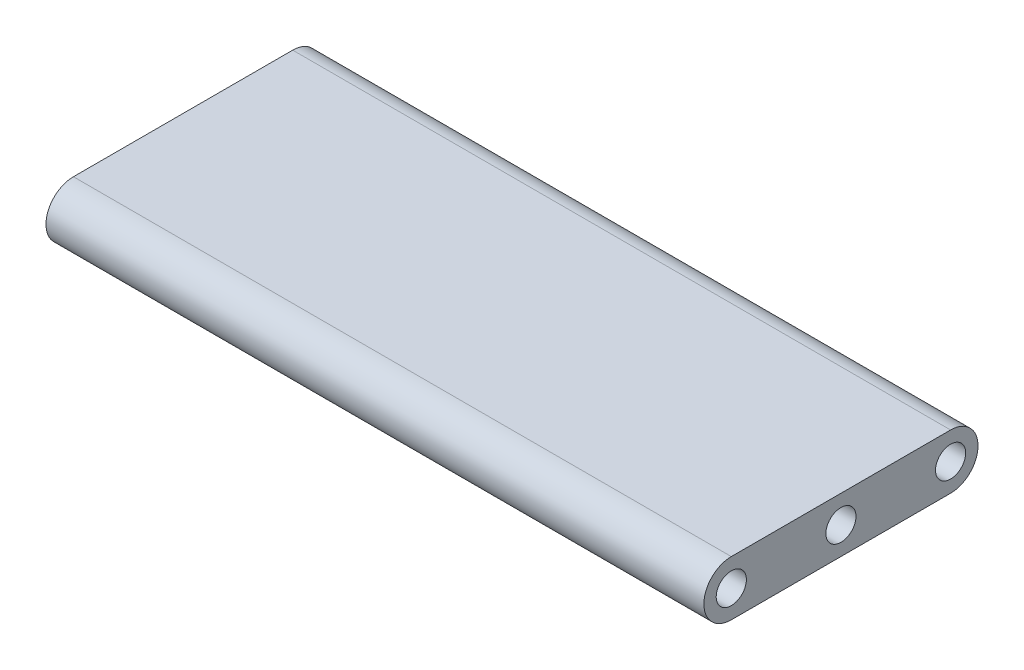
ISO-10303-21;
HEADER;
FILE_DESCRIPTION(('STEP AP214'),'2;1');
FILE_NAME('part.step','',(''),(''),'','','');
FILE_SCHEMA(('AUTOMOTIVE_DESIGN { 1 0 10303 214 1 1 1 1 }'));
ENDSEC;
DATA;
#1=APPLICATION_CONTEXT('core data for automotive mechanical design processes');
#2=APPLICATION_PROTOCOL_DEFINITION('international standard','automotive_design',2000,#1);
#3=PRODUCT_CONTEXT('',#1,'mechanical');
#4=PRODUCT('Part','Part','',(#3));
#5=PRODUCT_RELATED_PRODUCT_CATEGORY('part','',(#4));
#6=PRODUCT_DEFINITION_FORMATION('','',#4);
#7=PRODUCT_DEFINITION_CONTEXT('part definition',#1,'design');
#8=PRODUCT_DEFINITION('design','',#6,#7);
#9=PRODUCT_DEFINITION_SHAPE('','',#8);
#10=(LENGTH_UNIT() NAMED_UNIT(*) SI_UNIT(.MILLI.,.METRE.));
#11=(NAMED_UNIT(*) PLANE_ANGLE_UNIT() SI_UNIT($,.RADIAN.));
#12=(NAMED_UNIT(*) SI_UNIT($,.STERADIAN.) SOLID_ANGLE_UNIT());
#13=UNCERTAINTY_MEASURE_WITH_UNIT(LENGTH_MEASURE(1.E-05),#10,'distance_accuracy_value','');
#14=(GEOMETRIC_REPRESENTATION_CONTEXT(3) GLOBAL_UNCERTAINTY_ASSIGNED_CONTEXT((#13)) GLOBAL_UNIT_ASSIGNED_CONTEXT((#10,
#11,#12)) REPRESENTATION_CONTEXT('',''));
#15=CARTESIAN_POINT('',(0.,0.,0.));
#16=DIRECTION('',(0.,0.,1.));
#17=DIRECTION('',(1.,0.,0.));
#18=AXIS2_PLACEMENT_3D('',#15,#16,#17);
#19=CARTESIAN_POINT('',(76.2,-6.35000000000001,0.));
#20=DIRECTION('',(0.,1.,0.));
#21=DIRECTION('',(0.,0.,1.));
#22=AXIS2_PLACEMENT_3D('',#19,#20,#21);
#23=PLANE('',#22);
#24=DIRECTION('',(0.,0.,-1.));
#25=VECTOR('',#24,1.);
#26=CARTESIAN_POINT('',(-76.2,-6.35000000000001,0.));
#27=LINE('',#26,#25);
#28=CARTESIAN_POINT('',(-76.2,-6.35000000000001,25.4));
#29=VERTEX_POINT('',#28);
#30=CARTESIAN_POINT('',(-76.2,-6.35,-25.4));
#31=VERTEX_POINT('',#30);
#32=EDGE_CURVE('E127',#29,#31,#27,.T.);
#33=ORIENTED_EDGE('',*,*,#32,.T.);
#34=DIRECTION('',(-1.,0.,0.));
#35=VECTOR('',#34,1.);
#36=CARTESIAN_POINT('',(76.2,-6.35,-25.4));
#37=LINE('',#36,#35);
#38=CARTESIAN_POINT('',(76.2,-6.35,-25.4));
#39=VERTEX_POINT('',#38);
#40=EDGE_CURVE('E11',#39,#31,#37,.T.);
#41=ORIENTED_EDGE('',*,*,#40,.F.);
#42=DIRECTION('',(0.,0.,-1.));
#43=VECTOR('',#42,1.);
#44=CARTESIAN_POINT('',(76.2,-6.35000000000001,0.));
#45=LINE('',#44,#43);
#46=CARTESIAN_POINT('',(76.2,-6.35000000000001,25.4));
#47=VERTEX_POINT('',#46);
#48=EDGE_CURVE('E96',#47,#39,#45,.T.);
#49=ORIENTED_EDGE('',*,*,#48,.F.);
#50=DIRECTION('',(-1.,0.,0.));
#51=VECTOR('',#50,1.);
#52=CARTESIAN_POINT('',(76.2,-6.35000000000001,25.4));
#53=LINE('',#52,#51);
#54=EDGE_CURVE('E111',#47,#29,#53,.T.);
#55=ORIENTED_EDGE('',*,*,#54,.T.);
#56=EDGE_LOOP('',(#33,#41,#49,#55));
#57=FACE_BOUND('',#56,.T.);
#58=ADVANCED_FACE('F47',(#57),#23,.F.);
#59=CARTESIAN_POINT('',(76.2,0.,-25.4));
#60=DIRECTION('',(-1.,0.,0.));
#61=DIRECTION('',(0.,0.,1.));
#62=AXIS2_PLACEMENT_3D('',#59,#60,#61);
#63=CYLINDRICAL_SURFACE('',#62,6.35000000000001);
#64=CARTESIAN_POINT('',(-76.2,0.,-25.4));
#65=DIRECTION('',(1.,0.,0.));
#66=DIRECTION('',(0.,0.,-1.));
#67=AXIS2_PLACEMENT_3D('',#64,#65,#66);
#68=CIRCLE('',#67,6.35000000000001);
#69=CARTESIAN_POINT('',(-76.2,6.35,-25.4));
#70=VERTEX_POINT('',#69);
#71=EDGE_CURVE('E102',#31,#70,#68,.T.);
#72=ORIENTED_EDGE('',*,*,#71,.T.);
#73=DIRECTION('',(-1.,0.,0.));
#74=VECTOR('',#73,1.);
#75=CARTESIAN_POINT('',(76.2,6.35,-25.4));
#76=LINE('',#75,#74);
#77=CARTESIAN_POINT('',(76.2,6.35,-25.4));
#78=VERTEX_POINT('',#77);
#79=EDGE_CURVE('E57',#78,#70,#76,.T.);
#80=ORIENTED_EDGE('',*,*,#79,.F.);
#81=CARTESIAN_POINT('',(76.2,0.,-25.4));
#82=DIRECTION('',(1.,0.,0.));
#83=DIRECTION('',(0.,0.,-1.));
#84=AXIS2_PLACEMENT_3D('',#81,#82,#83);
#85=CIRCLE('',#84,6.35000000000001);
#86=EDGE_CURVE('E91',#39,#78,#85,.T.);
#87=ORIENTED_EDGE('',*,*,#86,.F.);
#88=ORIENTED_EDGE('',*,*,#40,.T.);
#89=EDGE_LOOP('',(#72,#80,#87,#88));
#90=FACE_BOUND('',#89,.T.);
#91=ADVANCED_FACE('F101',(#90),#63,.T.);
#92=CARTESIAN_POINT('',(76.2,6.35,0.));
#93=DIRECTION('',(0.,1.,0.));
#94=DIRECTION('',(0.,0.,1.));
#95=AXIS2_PLACEMENT_3D('',#92,#93,#94);
#96=PLANE('',#95);
#97=DIRECTION('',(0.,0.,-1.));
#98=VECTOR('',#97,1.);
#99=CARTESIAN_POINT('',(-76.2,6.35,0.));
#100=LINE('',#99,#98);
#101=CARTESIAN_POINT('',(-76.2,6.35000000000001,25.4));
#102=VERTEX_POINT('',#101);
#103=EDGE_CURVE('E133',#102,#70,#100,.T.);
#104=ORIENTED_EDGE('',*,*,#103,.F.);
#105=DIRECTION('',(-1.,0.,0.));
#106=VECTOR('',#105,1.);
#107=CARTESIAN_POINT('',(76.2,6.35000000000001,25.4));
#108=LINE('',#107,#106);
#109=CARTESIAN_POINT('',(76.2,6.35000000000001,25.4));
#110=VERTEX_POINT('',#109);
#111=EDGE_CURVE('E81',#110,#102,#108,.T.);
#112=ORIENTED_EDGE('',*,*,#111,.F.);
#113=DIRECTION('',(0.,0.,-1.));
#114=VECTOR('',#113,1.);
#115=CARTESIAN_POINT('',(76.2,6.35,0.));
#116=LINE('',#115,#114);
#117=EDGE_CURVE('E94',#110,#78,#116,.T.);
#118=ORIENTED_EDGE('',*,*,#117,.T.);
#119=ORIENTED_EDGE('',*,*,#79,.T.);
#120=EDGE_LOOP('',(#104,#112,#118,#119));
#121=FACE_BOUND('',#120,.T.);
#122=ADVANCED_FACE('F107',(#121),#96,.T.);
#123=CARTESIAN_POINT('',(76.2,0.,-25.4));
#124=DIRECTION('',(-1.,0.,0.));
#125=DIRECTION('',(0.,0.,1.));
#126=AXIS2_PLACEMENT_3D('',#123,#124,#125);
#127=CYLINDRICAL_SURFACE('',#126,3.4925);
#128=CARTESIAN_POINT('',(76.2,0.,-25.4));
#129=DIRECTION('',(1.,0.,0.));
#130=DIRECTION('',(0.,0.,-1.));
#131=AXIS2_PLACEMENT_3D('',#128,#129,#130);
#132=CIRCLE('',#131,3.4925);
#133=CARTESIAN_POINT('',(76.2,0.,-28.8925));
#134=VERTEX_POINT('',#133);
#135=EDGE_CURVE('E185',#134,#134,#132,.T.);
#136=ORIENTED_EDGE('',*,*,#135,.T.);
#137=EDGE_LOOP('',(#136));
#138=FACE_BOUND('',#137,.T.);
#139=CARTESIAN_POINT('',(-76.2,0.,-25.4));
#140=DIRECTION('',(1.,0.,0.));
#141=DIRECTION('',(0.,0.,-1.));
#142=AXIS2_PLACEMENT_3D('',#139,#140,#141);
#143=CIRCLE('',#142,3.4925);
#144=CARTESIAN_POINT('',(-76.2,0.,-28.8925));
#145=VERTEX_POINT('',#144);
#146=EDGE_CURVE('E123',#145,#145,#143,.T.);
#147=ORIENTED_EDGE('',*,*,#146,.F.);
#148=EDGE_LOOP('',(#147));
#149=FACE_BOUND('',#148,.T.);
#150=ADVANCED_FACE('F165',(#138,#149),#127,.F.);
#151=CARTESIAN_POINT('',(76.2,0.,25.4));
#152=DIRECTION('',(-1.,0.,0.));
#153=DIRECTION('',(0.,0.,1.));
#154=AXIS2_PLACEMENT_3D('',#151,#152,#153);
#155=CYLINDRICAL_SURFACE('',#154,3.4925);
#156=CARTESIAN_POINT('',(76.2,0.,25.4));
#157=DIRECTION('',(1.,0.,0.));
#158=DIRECTION('',(0.,0.,-1.));
#159=AXIS2_PLACEMENT_3D('',#156,#157,#158);
#160=CIRCLE('',#159,3.4925);
#161=CARTESIAN_POINT('',(76.2,0.,21.9075));
#162=VERTEX_POINT('',#161);
#163=EDGE_CURVE('E178',#162,#162,#160,.T.);
#164=ORIENTED_EDGE('',*,*,#163,.T.);
#165=EDGE_LOOP('',(#164));
#166=FACE_BOUND('',#165,.T.);
#167=CARTESIAN_POINT('',(-76.2,0.,25.4));
#168=DIRECTION('',(1.,0.,0.));
#169=DIRECTION('',(0.,0.,-1.));
#170=AXIS2_PLACEMENT_3D('',#167,#168,#169);
#171=CIRCLE('',#170,3.4925);
#172=CARTESIAN_POINT('',(-76.2,0.,21.9075));
#173=VERTEX_POINT('',#172);
#174=EDGE_CURVE('E119',#173,#173,#171,.T.);
#175=ORIENTED_EDGE('',*,*,#174,.F.);
#176=EDGE_LOOP('',(#175));
#177=FACE_BOUND('',#176,.T.);
#178=ADVANCED_FACE('F167',(#166,#177),#155,.F.);
#179=CARTESIAN_POINT('',(76.2,0.,0.));
#180=DIRECTION('',(-1.,0.,0.));
#181=DIRECTION('',(0.,0.,1.));
#182=AXIS2_PLACEMENT_3D('',#179,#180,#181);
#183=CYLINDRICAL_SURFACE('',#182,3.4925);
#184=CARTESIAN_POINT('',(76.2,0.,0.));
#185=DIRECTION('',(1.,0.,0.));
#186=DIRECTION('',(0.,0.,-1.));
#187=AXIS2_PLACEMENT_3D('',#184,#185,#186);
#188=CIRCLE('',#187,3.4925);
#189=CARTESIAN_POINT('',(76.2,0.,-3.49249999999999));
#190=VERTEX_POINT('',#189);
#191=EDGE_CURVE('E138',#190,#190,#188,.T.);
#192=ORIENTED_EDGE('',*,*,#191,.T.);
#193=EDGE_LOOP('',(#192));
#194=FACE_BOUND('',#193,.T.);
#195=CARTESIAN_POINT('',(-76.2,0.,0.));
#196=DIRECTION('',(1.,0.,0.));
#197=DIRECTION('',(0.,0.,-1.));
#198=AXIS2_PLACEMENT_3D('',#195,#196,#197);
#199=CIRCLE('',#198,3.4925);
#200=CARTESIAN_POINT('',(-76.2,0.,-3.49249999999999));
#201=VERTEX_POINT('',#200);
#202=EDGE_CURVE('E115',#201,#201,#199,.T.);
#203=ORIENTED_EDGE('',*,*,#202,.F.);
#204=EDGE_LOOP('',(#203));
#205=FACE_BOUND('',#204,.T.);
#206=ADVANCED_FACE('F49',(#194,#205),#183,.F.);
#207=CARTESIAN_POINT('',(76.2,0.,25.4));
#208=DIRECTION('',(-1.,0.,0.));
#209=DIRECTION('',(0.,0.,1.));
#210=AXIS2_PLACEMENT_3D('',#207,#208,#209);
#211=CYLINDRICAL_SURFACE('',#210,6.35);
#212=CARTESIAN_POINT('',(-76.2,0.,25.4));
#213=DIRECTION('',(1.,0.,0.));
#214=DIRECTION('',(0.,0.,-1.));
#215=AXIS2_PLACEMENT_3D('',#212,#213,#214);
#216=CIRCLE('',#215,6.35);
#217=EDGE_CURVE('E84',#102,#29,#216,.T.);
#218=ORIENTED_EDGE('',*,*,#217,.T.);
#219=ORIENTED_EDGE('',*,*,#54,.F.);
#220=CARTESIAN_POINT('',(76.2,0.,25.4));
#221=DIRECTION('',(1.,0.,0.));
#222=DIRECTION('',(0.,0.,-1.));
#223=AXIS2_PLACEMENT_3D('',#220,#221,#222);
#224=CIRCLE('',#223,6.35);
#225=EDGE_CURVE('E65',#110,#47,#224,.T.);
#226=ORIENTED_EDGE('',*,*,#225,.F.);
#227=ORIENTED_EDGE('',*,*,#111,.T.);
#228=EDGE_LOOP('',(#218,#219,#226,#227));
#229=FACE_BOUND('',#228,.T.);
#230=ADVANCED_FACE('F152',(#229),#211,.T.);
#231=CARTESIAN_POINT('',(76.2,0.,0.));
#232=DIRECTION('',(1.,0.,0.));
#233=DIRECTION('',(0.,0.,-1.));
#234=AXIS2_PLACEMENT_3D('',#231,#232,#233);
#235=PLANE('',#234);
#236=ORIENTED_EDGE('',*,*,#191,.F.);
#237=EDGE_LOOP('',(#236));
#238=FACE_BOUND('',#237,.T.);
#239=ORIENTED_EDGE('',*,*,#163,.F.);
#240=EDGE_LOOP('',(#239));
#241=FACE_BOUND('',#240,.T.);
#242=ORIENTED_EDGE('',*,*,#135,.F.);
#243=EDGE_LOOP('',(#242));
#244=FACE_BOUND('',#243,.T.);
#245=ORIENTED_EDGE('',*,*,#48,.T.);
#246=ORIENTED_EDGE('',*,*,#86,.T.);
#247=ORIENTED_EDGE('',*,*,#117,.F.);
#248=ORIENTED_EDGE('',*,*,#225,.T.);
#249=EDGE_LOOP('',(#245,#246,#247,#248));
#250=FACE_BOUND('',#249,.T.);
#251=ADVANCED_FACE('F92',(#238,#241,#244,#250),#235,.T.);
#252=CARTESIAN_POINT('',(-76.2,0.,0.));
#253=DIRECTION('',(1.,0.,0.));
#254=DIRECTION('',(0.,0.,-1.));
#255=AXIS2_PLACEMENT_3D('',#252,#253,#254);
#256=PLANE('',#255);
#257=ORIENTED_EDGE('',*,*,#202,.T.);
#258=EDGE_LOOP('',(#257));
#259=FACE_BOUND('',#258,.T.);
#260=ORIENTED_EDGE('',*,*,#174,.T.);
#261=EDGE_LOOP('',(#260));
#262=FACE_BOUND('',#261,.T.);
#263=ORIENTED_EDGE('',*,*,#146,.T.);
#264=EDGE_LOOP('',(#263));
#265=FACE_BOUND('',#264,.T.);
#266=ORIENTED_EDGE('',*,*,#32,.F.);
#267=ORIENTED_EDGE('',*,*,#217,.F.);
#268=ORIENTED_EDGE('',*,*,#103,.T.);
#269=ORIENTED_EDGE('',*,*,#71,.F.);
#270=EDGE_LOOP('',(#266,#267,#268,#269));
#271=FACE_BOUND('',#270,.T.);
#272=ADVANCED_FACE('F145',(#259,#262,#265,#271),#256,.F.);
#273=CLOSED_SHELL('',(#58,#91,#122,#150,#178,#206,#230,#251,#272));
#274=MANIFOLD_SOLID_BREP('B2',#273);
#275=ADVANCED_BREP_SHAPE_REPRESENTATION('',(#18,#274),#14);
#276=SHAPE_DEFINITION_REPRESENTATION(#9,#275);
ENDSEC;
END-ISO-10303-21;
